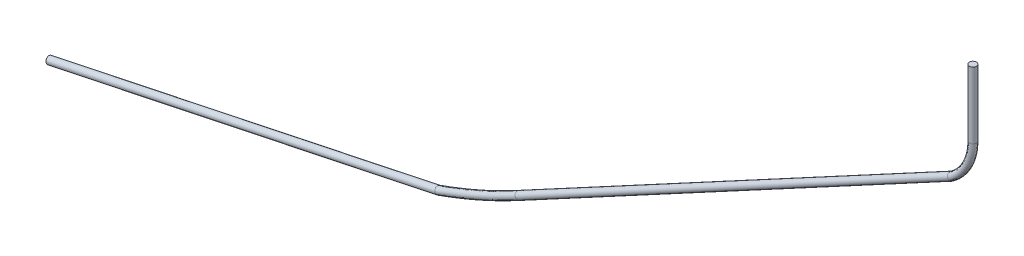
ISO-10303-21;
HEADER;
FILE_DESCRIPTION(('STEP AP214'),'2;1');
FILE_NAME('part.step','',(''),(''),'','','');
FILE_SCHEMA(('AUTOMOTIVE_DESIGN { 1 0 10303 214 1 1 1 1 }'));
ENDSEC;
DATA;
#1=APPLICATION_CONTEXT('core data for automotive mechanical design processes');
#2=APPLICATION_PROTOCOL_DEFINITION('international standard','automotive_design',2000,#1);
#3=PRODUCT_CONTEXT('',#1,'mechanical');
#4=PRODUCT('Part','Part','',(#3));
#5=PRODUCT_RELATED_PRODUCT_CATEGORY('part','',(#4));
#6=PRODUCT_DEFINITION_FORMATION('','',#4);
#7=PRODUCT_DEFINITION_CONTEXT('part definition',#1,'design');
#8=PRODUCT_DEFINITION('design','',#6,#7);
#9=PRODUCT_DEFINITION_SHAPE('','',#8);
#10=(LENGTH_UNIT() NAMED_UNIT(*) SI_UNIT(.MILLI.,.METRE.));
#11=(NAMED_UNIT(*) PLANE_ANGLE_UNIT() SI_UNIT($,.RADIAN.));
#12=(NAMED_UNIT(*) SI_UNIT($,.STERADIAN.) SOLID_ANGLE_UNIT());
#13=UNCERTAINTY_MEASURE_WITH_UNIT(LENGTH_MEASURE(1.E-05),#10,'distance_accuracy_value','');
#14=(GEOMETRIC_REPRESENTATION_CONTEXT(3) GLOBAL_UNCERTAINTY_ASSIGNED_CONTEXT((#13)) GLOBAL_UNIT_ASSIGNED_CONTEXT((#10,
#11,#12)) REPRESENTATION_CONTEXT('',''));
#15=CARTESIAN_POINT('',(0.,0.,0.));
#16=DIRECTION('',(0.,0.,1.));
#17=DIRECTION('',(1.,0.,0.));
#18=AXIS2_PLACEMENT_3D('',#15,#16,#17);
#19=CARTESIAN_POINT('',(-898.137852558053,-445.671560942577,0.));
#20=DIRECTION('',(0.978565795137452,0.205934418169975,0.));
#21=DIRECTION('',(0.,0.,1.));
#22=AXIS2_PLACEMENT_3D('',#19,#20,#21);
#23=PLANE('',#22);
#24=CARTESIAN_POINT('',(-898.137852558053,-445.671560942577,0.));
#25=DIRECTION('',(0.978565795137452,0.205934418169975,0.));
#26=DIRECTION('',(0.,0.,1.));
#27=AXIS2_PLACEMENT_3D('',#24,#25,#26);
#28=CIRCLE('',#27,3.5);
#29=CARTESIAN_POINT('',(-898.137852558053,-445.671560942577,3.5));
#30=VERTEX_POINT('',#29);
#31=EDGE_CURVE('E39',#30,#30,#28,.T.);
#32=ORIENTED_EDGE('',*,*,#31,.F.);
#33=EDGE_LOOP('',(#32));
#34=FACE_BOUND('',#33,.T.);
#35=ADVANCED_FACE('F36',(#34),#23,.F.);
#36=CARTESIAN_POINT('',(0.,0.,0.));
#37=DIRECTION('',(0.,1.,0.));
#38=DIRECTION('',(0.,0.,1.));
#39=AXIS2_PLACEMENT_3D('',#36,#37,#38);
#40=PLANE('',#39);
#41=CARTESIAN_POINT('',(0.,0.,0.));
#42=DIRECTION('',(0.,1.,0.));
#43=DIRECTION('',(0.,0.,1.));
#44=AXIS2_PLACEMENT_3D('',#41,#42,#43);
#45=CIRCLE('',#44,3.5);
#46=CARTESIAN_POINT('',(0.,0.,3.5));
#47=VERTEX_POINT('',#46);
#48=EDGE_CURVE('E65',#47,#47,#45,.T.);
#49=ORIENTED_EDGE('',*,*,#48,.T.);
#50=EDGE_LOOP('',(#49));
#51=FACE_BOUND('',#50,.T.);
#52=ADVANCED_FACE('F91',(#51),#40,.T.);
#53=CARTESIAN_POINT('',(-519.146494057283,-365.91467050953,0.));
#54=DIRECTION('',(-0.978565795137452,-0.205934418169975,0.));
#55=DIRECTION('',(0.205934418169975,-0.978565795137452,0.));
#56=AXIS2_PLACEMENT_3D('',#53,#54,#55);
#57=CYLINDRICAL_SURFACE('',#56,3.5);
#58=CARTESIAN_POINT('',(-519.747286679381,-366.04110439848,3.5));
#59=CARTESIAN_POINT('',(-519.750214648201,-366.030689824779,3.50000006878347));
#60=CARTESIAN_POINT('',(-519.753142782601,-366.020274700953,3.49995012027578));
#61=CARTESIAN_POINT('',(-519.782754392659,-365.914949126424,3.49893943176804));
#62=CARTESIAN_POINT('',(-519.80943963636,-365.820035566233,3.49387711805509));
#63=CARTESIAN_POINT('',(-519.862608962249,-365.630930289061,3.47548027968782));
#64=CARTESIAN_POINT('',(-519.88909293759,-365.536738955279,3.46214163487605));
#65=CARTESIAN_POINT('',(-519.941724449248,-365.349559043257,3.42724049778449));
#66=CARTESIAN_POINT('',(-519.967871144377,-365.256573469992,3.40566046897477));
#67=CARTESIAN_POINT('',(-520.019593843168,-365.072637825458,3.35442660372648));
#68=CARTESIAN_POINT('',(-520.045169397664,-364.981689356081,3.32476663921876));
#69=CARTESIAN_POINT('',(-520.120645731476,-364.713298683893,3.22408897234145));
#70=CARTESIAN_POINT('',(-520.169436174683,-364.539813345614,3.14128010393702));
#71=CARTESIAN_POINT('',(-520.262555279951,-364.208726252431,2.94650843913767));
#72=CARTESIAN_POINT('',(-520.306883760261,-364.051125144543,2.83454445582457));
#73=CARTESIAN_POINT('',(-520.369036941189,-363.830162675809,2.64733154354006));
#74=CARTESIAN_POINT('',(-520.389033849188,-363.759073053451,2.58170579117452));
#75=CARTESIAN_POINT('',(-520.427443961739,-363.622527096453,2.44450868856838));
#76=CARTESIAN_POINT('',(-520.44585867687,-363.557065388599,2.37294314057821));
#77=CARTESIAN_POINT('',(-520.48099561074,-363.432161192744,2.22428903470256));
#78=CARTESIAN_POINT('',(-520.49771699296,-363.372721679746,2.14719777887991));
#79=CARTESIAN_POINT('',(-520.529338630847,-363.260318327463,1.98808167654543));
#80=CARTESIAN_POINT('',(-520.544238466455,-363.207355981844,1.90605569854487));
#81=CARTESIAN_POINT('',(-520.585966860817,-363.059032352564,1.65383183847587));
#82=CARTESIAN_POINT('',(-520.609937454376,-362.973832272474,1.47700836710633));
#83=CARTESIAN_POINT('',(-520.649466186221,-362.833335768093,1.11108940545167));
#84=CARTESIAN_POINT('',(-520.665024597927,-362.778038371874,0.921994314255171));
#85=CARTESIAN_POINT('',(-520.687280251381,-362.6989384465,0.537185029431597));
#86=CARTESIAN_POINT('',(-520.693994771738,-362.675074504737,0.341484510989795));
#87=CARTESIAN_POINT('',(-520.698419306362,-362.659349309498,-0.0512922156745198));
#88=CARTESIAN_POINT('',(-520.696129375502,-362.667487860998,-0.248368415506313));
#89=CARTESIAN_POINT('',(-520.682619317864,-362.715504098756,-0.638113208493365));
#90=CARTESIAN_POINT('',(-520.671407665151,-362.755351667024,-0.830785805738043));
#91=CARTESIAN_POINT('',(-520.640387110228,-362.865605237682,-1.20645365501564));
#92=CARTESIAN_POINT('',(-520.620578099358,-362.936011626296,-1.38944878470456));
#93=CARTESIAN_POINT('',(-520.572919210526,-363.10540972609,-1.74067726365213));
#94=CARTESIAN_POINT('',(-520.545065043645,-363.2044166844,-1.90890267655009));
#95=CARTESIAN_POINT('',(-520.482120641833,-363.42816100116,-2.22572221257332));
#96=CARTESIAN_POINT('',(-520.447030971433,-363.552896352213,-2.37431786578085));
#97=CARTESIAN_POINT('',(-520.370470513009,-363.825064692158,-2.64823767537412));
#98=CARTESIAN_POINT('',(-520.328976151535,-363.972581532935,-2.77347192498144));
#99=CARTESIAN_POINT('',(-520.240866490852,-364.285839268694,-2.99649736850896));
#100=CARTESIAN_POINT('',(-520.194248677317,-364.451589111526,-3.09427500371841));
#101=CARTESIAN_POINT('',(-520.097209421749,-364.796634761972,-3.25962099661543));
#102=CARTESIAN_POINT('',(-520.046785203682,-364.975940456095,-3.32716705255694));
#103=CARTESIAN_POINT('',(-519.943674063839,-365.342622623701,-3.42994404279201));
#104=CARTESIAN_POINT('',(-519.890992096333,-365.52998142833,-3.46524228491912));
#105=CARTESIAN_POINT('',(-519.810712597042,-365.815507915364,-3.49363973371605));
#106=CARTESIAN_POINT('',(-519.78339390064,-365.912674458512,-3.49891834885253));
#107=CARTESIAN_POINT('',(-519.753142862045,-366.02027441849,-3.49995003778511));
#108=CARTESIAN_POINT('',(-519.750214736553,-366.030689510649,-3.49999997729214));
#109=CARTESIAN_POINT('',(-519.747286679379,-366.04110439848,-3.5));
#110=B_SPLINE_CURVE_WITH_KNOTS('',3,(#58,#59,#60,#61,#62,#63,#64,#65,#66,#67,#68,#69,#70,#71,
#72,#73,#74,#75,#76,#77,#78,#79,#80,#81,#82,#83,#84,#85,#86,#87,#88,#89,#90,#91,#92,#93,#94,#95,
#96,#97,#98,#99,#100,#101,#102,#103,#104,#105,#106,#107,#108,#109),.UNSPECIFIED.,.F.,.F.,(4,2,2,
2,2,2,2,2,2,2,2,2,2,2,2,2,2,2,2,2,2,2,2,2,2,4),(0.,0.0324565384115636,0.328223761174329,
0.624138342266367,0.920686129182382,1.21745945616055,1.80944958555931,2.40146381891809,
2.69755192387965,2.99335412651982,3.28930175207596,3.58531749639975,4.17546480591187,
4.76559293269344,5.35456638753079,5.94353625316442,6.53194736778971,7.12036591941917,
7.70909874115067,8.29778564577167,8.88869337848649,9.47989240398172,10.0715268392895,
10.6619235714441,10.9647875053273,10.9972440437389),.UNSPECIFIED.);
#111=CARTESIAN_POINT('',(-519.747286679381,-366.04110439848,3.5));
#112=VERTEX_POINT('',#111);
#113=CARTESIAN_POINT('',(-519.747286679379,-366.04110439848,-3.5));
#114=VERTEX_POINT('',#113);
#115=EDGE_CURVE('E59',#112,#114,#110,.T.);
#116=ORIENTED_EDGE('',*,*,#115,.T.);
#117=CARTESIAN_POINT('',(-519.747286679381,-366.04110439848,3.5));
#118=CARTESIAN_POINT('',(-519.744358710524,-366.051518972171,3.50000006878315));
#119=CARTESIAN_POINT('',(-519.741430586221,-366.061934098836,3.49995012027541));
#120=CARTESIAN_POINT('',(-519.711819422165,-366.167258871381,3.49893943982253));
#121=CARTESIAN_POINT('',(-519.685135444111,-366.262171859858,3.49387720779657));
#122=CARTESIAN_POINT('',(-519.631970296148,-366.45127647259,3.4754806501913));
#123=CARTESIAN_POINT('',(-519.605489233905,-366.545467713898,3.46214220463247));
#124=CARTESIAN_POINT('',(-519.552865126912,-366.732647901546,3.42724155613277));
#125=CARTESIAN_POINT('',(-519.526722926686,-366.825633843994,3.40566181735074));
#126=CARTESIAN_POINT('',(-519.475010670011,-367.009570662495,3.35442859744977));
#127=CARTESIAN_POINT('',(-519.449441063833,-367.100519936971,3.32476898824864));
#128=CARTESIAN_POINT('',(-519.373984478467,-367.368913666968,3.22409242951257));
#129=CARTESIAN_POINT('',(-519.325209777926,-367.542401837309,3.14128436975542));
#130=CARTESIAN_POINT('',(-519.232125625618,-367.873495624767,2.94651441694784));
#131=CARTESIAN_POINT('',(-519.187816355702,-368.031100595054,2.83455133725192));
#132=CARTESIAN_POINT('',(-519.125693053065,-368.252068843527,2.64734018839676));
#133=CARTESIAN_POINT('',(-519.105706325222,-368.323160240496,2.5817152700497));
#134=CARTESIAN_POINT('',(-519.067316591346,-368.459709849542,2.44451993904727));
#135=CARTESIAN_POINT('',(-519.048912074704,-368.525173434749,2.37295532855944));
#136=CARTESIAN_POINT('',(-519.013795278612,-368.650081437662,2.22430320578393));
#137=CARTESIAN_POINT('',(-518.997083835574,-368.709522880314,2.14721299554366));
#138=CARTESIAN_POINT('',(-518.965481527517,-368.821930097873,1.98809909254164));
#139=CARTESIAN_POINT('',(-518.95059108244,-368.874894379079,1.906074268289));
#140=CARTESIAN_POINT('',(-518.908889416567,-369.023224316605,1.65385306762238));
#141=CARTESIAN_POINT('',(-518.884934987261,-369.108428565579,1.47703116294079));
#142=CARTESIAN_POINT('',(-518.84543347577,-369.248932713168,1.11111550740384));
#143=CARTESIAN_POINT('',(-518.829886120999,-369.304233581356,0.92202215465498));
#144=CARTESIAN_POINT('',(-518.807646011186,-369.383340117924,0.537213838483462));
#145=CARTESIAN_POINT('',(-518.800936104479,-369.407206793595,0.341512459638252));
#146=CARTESIAN_POINT('',(-518.796514060651,-369.422935698665,-0.0512662260287994));
#147=CARTESIAN_POINT('',(-518.798801869221,-369.414798121242,-0.248343524538442));
#148=CARTESIAN_POINT('',(-518.81230122187,-369.366781854619,-0.638092385999702));
#149=CARTESIAN_POINT('',(-518.823504369769,-369.326933030051,-0.8307679188478));
#150=CARTESIAN_POINT('',(-518.854502518158,-369.216674755749,-1.20644173318995));
#151=CARTESIAN_POINT('',(-518.874297627136,-369.146264920129,-1.3894398924579));
#152=CARTESIAN_POINT('',(-518.921924796573,-368.976858372249,-1.74067350621555));
#153=CARTESIAN_POINT('',(-518.949761108351,-368.877846538348,-1.90890109011684));
#154=CARTESIAN_POINT('',(-519.012667962721,-368.6540912211,-2.22572466187988));
#155=CARTESIAN_POINT('',(-519.04773794019,-368.529349747861,-2.37432218183882));
#156=CARTESIAN_POINT('',(-519.124258489188,-368.257171485609,-2.64824212096325));
#157=CARTESIAN_POINT('',(-519.16573249878,-368.10965132909,-2.77347515287608));
#158=CARTESIAN_POINT('',(-519.253803822521,-367.796387799845,-2.99649853544984));
#159=CARTESIAN_POINT('',(-519.30040365174,-367.630635481202,-3.09427532989931));
#160=CARTESIAN_POINT('',(-519.397411271215,-367.285586221336,-3.25962003621849));
#161=CARTESIAN_POINT('',(-519.447821840327,-367.106279395939,-3.32716564970618));
#162=CARTESIAN_POINT('',(-519.550911542159,-366.739596659092,-3.42994230210226));
#163=CARTESIAN_POINT('',(-519.603585708742,-366.552238411775,-3.46524064340196));
#164=CARTESIAN_POINT('',(-519.683859866157,-366.266708998777,-3.49363930981879));
#165=CARTESIAN_POINT('',(-519.711178586674,-366.169538276966,-3.49891831141344));
#166=CARTESIAN_POINT('',(-519.741430506818,-366.061934381266,-3.49995003779244));
#167=CARTESIAN_POINT('',(-519.744358622218,-366.051519286266,-3.49999997730038));
#168=CARTESIAN_POINT('',(-519.747286679379,-366.04110439848,-3.5));
#169=B_SPLINE_CURVE_WITH_KNOTS('',3,(#117,#118,#119,#120,#121,#122,#123,#124,#125,#126,#127,
#128,#129,#130,#131,#132,#133,#134,#135,#136,#137,#138,#139,#140,#141,#142,#143,#144,#145,#146,
#147,#148,#149,#150,#151,#152,#153,#154,#155,#156,#157,#158,#159,#160,#161,#162,#163,#164,#165,
#166,#167,#168),.UNSPECIFIED.,.F.,.F.,(4,2,2,2,2,2,2,2,2,2,2,2,2,2,2,2,2,2,2,2,2,2,2,2,2,4),(0.,
0.0324565384116534,0.328221082921768,0.624132980153514,0.920678059461849,1.21744867907985,
1.8094336090267,2.40144263726187,2.69752673726918,2.99332493795039,3.28926856328697,
3.58528030810162,4.17542300813214,4.76554657249785,5.35452313263621,5.94349613772655,
6.53191512247796,7.12034153723936,7.7090796193488,8.29777172414722,8.88867180985538,
9.47986313496338,10.0714898043646,10.661878866274,10.964754881324,10.9972114197356),.UNSPECIFIED.);
#170=EDGE_CURVE('E61',#112,#114,#169,.T.);
#171=ORIENTED_EDGE('',*,*,#170,.F.);
#172=EDGE_LOOP('',(#116,#171));
#173=FACE_BOUND('',#172,.T.);
#174=ORIENTED_EDGE('',*,*,#31,.T.);
#175=EDGE_LOOP('',(#174));
#176=FACE_BOUND('',#175,.T.);
#177=ADVANCED_FACE('F67',(#173,#176),#57,.T.);
#178=CARTESIAN_POINT('',(-20.3028847668204,-104.511621788096,0.));
#179=DIRECTION('',(-0.880443398622848,-0.474151264705102,0.));
#180=DIRECTION('',(0.474151264705102,-0.880443398622848,0.));
#181=AXIS2_PLACEMENT_3D('',#178,#179,#180);
#182=CYLINDRICAL_SURFACE('',#181,3.5);
#183=CARTESIAN_POINT('',(-20.7969174996662,-104.777676648011,3.5));
#184=CARTESIAN_POINT('',(-20.7909133354502,-104.787386334399,3.50000007725062));
#185=CARTESIAN_POINT('',(-20.7849088360938,-104.797096563148,3.49994440719893));
#186=CARTESIAN_POINT('',(-20.7270913875814,-104.890596560323,3.49887183682657));
#187=CARTESIAN_POINT('',(-20.6752779821097,-104.974387094795,3.49376179794762));
#188=CARTESIAN_POINT('',(-20.5720474258439,-105.14132740995,3.47527527274221));
#189=CARTESIAN_POINT('',(-20.520630483544,-105.224476853491,3.46189470219053));
#190=CARTESIAN_POINT('',(-20.4184557005492,-105.389709916654,3.42691610363959));
#191=CARTESIAN_POINT('',(-20.367699500306,-105.471790883507,3.40530060257945));
#192=CARTESIAN_POINT('',(-20.2673003954171,-105.634152483353,3.35400288268269));
#193=CARTESIAN_POINT('',(-20.2176583670928,-105.714431699226,3.32431453955193));
#194=CARTESIAN_POINT('',(-20.0711677595167,-105.951330845174,3.22356395559591));
#195=CARTESIAN_POINT('',(-19.9764822718588,-106.104452765304,3.14072234472893));
#196=CARTESIAN_POINT('',(-19.7957879639359,-106.396665136464,2.9459221346528));
#197=CARTESIAN_POINT('',(-19.7097795161495,-106.53575498514,2.83396228622462));
#198=CARTESIAN_POINT('',(-19.5891886438571,-106.730770383343,2.6467737295214));
#199=CARTESIAN_POINT('',(-19.5503872652484,-106.793518645598,2.58115188807667));
#200=CARTESIAN_POINT('',(-19.4758607625296,-106.914040374655,2.44397061813086));
#201=CARTESIAN_POINT('',(-19.4401327036346,-106.971818587472,2.37241698522231));
#202=CARTESIAN_POINT('',(-19.3719629053783,-107.082060502304,2.22379481925245));
#203=CARTESIAN_POINT('',(-19.339522793827,-107.134521571887,2.14672358642368));
#204=CARTESIAN_POINT('',(-19.2781774570155,-107.233727221625,1.98765553287906));
#205=CARTESIAN_POINT('',(-19.2492730485233,-107.280470480933,1.90565758056162));
#206=CARTESIAN_POINT('',(-19.1683025429696,-107.411413333155,1.65345890371491));
#207=CARTESIAN_POINT('',(-19.1217884646919,-107.486634395915,1.47663676041726));
#208=CARTESIAN_POINT('',(-19.045090412775,-107.610668017567,1.11073575660585));
#209=CARTESIAN_POINT('',(-19.0149059488759,-107.659481369291,0.921657264252173));
#210=CARTESIAN_POINT('',(-18.9717244635495,-107.72931309234,0.536816010361488));
#211=CARTESIAN_POINT('',(-18.9587006553144,-107.750374782431,0.341064156792314));
#212=CARTESIAN_POINT('',(-18.9501385910102,-107.764221081379,-0.0518103148316515));
#213=CARTESIAN_POINT('',(-18.9546002527233,-107.757005823197,-0.248932926436707));
#214=CARTESIAN_POINT('',(-18.9808676262858,-107.714527060679,-0.638803717828214));
#215=CARTESIAN_POINT('',(-19.0026601825102,-107.679284831202,-0.831555101647564));
#216=CARTESIAN_POINT('',(-19.0629492669372,-107.581787252367,-1.20737156151601));
#217=CARTESIAN_POINT('',(-19.1014460100202,-107.51953155551,-1.39043651292618));
#218=CARTESIAN_POINT('',(-19.1940620090978,-107.369755964797,-1.74177257310457));
#219=CARTESIAN_POINT('',(-19.2481880554798,-107.282225089757,-1.91003721010858));
#220=CARTESIAN_POINT('',(-19.3705053464423,-107.084417612679,-2.22691603720949));
#221=CARTESIAN_POINT('',(-19.4386954445282,-106.974142864711,-2.37553182745125));
#222=CARTESIAN_POINT('',(-19.5874248732384,-106.733622683836,-2.64935563704554));
#223=CARTESIAN_POINT('',(-19.6680004254278,-106.603318674868,-2.77449252775528));
#224=CARTESIAN_POINT('',(-19.8390995126611,-106.326623236669,-2.99733092499503));
#225=CARTESIAN_POINT('',(-19.9296279314008,-106.180223909751,-3.09501887847126));
#226=CARTESIAN_POINT('',(-20.118079840077,-105.875466361385,-3.26019079991481));
#227=CARTESIAN_POINT('',(-20.216008851499,-105.717099210902,-3.32765195079715));
#228=CARTESIAN_POINT('',(-20.4162694410358,-105.393245428752,-3.43025870394954));
#229=CARTESIAN_POINT('',(-20.5185913321379,-105.227774462172,-3.46547193628119));
#230=CARTESIAN_POINT('',(-20.6739378640591,-104.9765542792,-3.49363543861803));
#231=CARTESIAN_POINT('',(-20.7264153684005,-104.891689790694,-3.49886008930057));
#232=CARTESIAN_POINT('',(-20.7849086592256,-104.797096849175,-3.49994431317133));
#233=CARTESIAN_POINT('',(-20.790913137857,-104.787386653942,-3.49999997236285));
#234=CARTESIAN_POINT('',(-20.7969174996678,-104.777676648012,-3.5));
#235=B_SPLINE_CURVE_WITH_KNOTS('',3,(#183,#184,#185,#186,#187,#188,#189,#190,#191,#192,#193,
#194,#195,#196,#197,#198,#199,#200,#201,#202,#203,#204,#205,#206,#207,#208,#209,#210,#211,#212,
#213,#214,#215,#216,#217,#218,#219,#220,#221,#222,#223,#224,#225,#226,#227,#228,#229,#230,#231,
#232,#233,#234),.UNSPECIFIED.,.F.,.F.,(4,2,2,2,2,2,2,2,2,2,2,2,2,2,2,2,2,2,2,2,2,2,2,2,2,4),(0.,
0.0342500808160557,0.329794395498746,0.625484775155667,0.921806083483203,1.21835282002983,
1.80988742593337,2.4014474138063,2.69736526474273,2.99299732500665,3.28877504025698,
3.58462095334378,4.17467686846553,4.76471506750739,5.35383115507379,5.94294447258482,
6.53161102926076,7.12028515868744,7.70921543230982,8.2980977155855,8.88873617018523,
9.4796657451396,10.0710406423485,10.6611724538486,10.9605816442305,10.9948317250465),.UNSPECIFIED.);
#236=CARTESIAN_POINT('',(-20.7969174996662,-104.777676648011,3.5));
#237=VERTEX_POINT('',#236);
#238=CARTESIAN_POINT('',(-20.7969174996678,-104.777676648012,-3.5));
#239=VERTEX_POINT('',#238);
#240=EDGE_CURVE('E11',#237,#239,#235,.T.);
#241=ORIENTED_EDGE('',*,*,#240,.F.);
#242=CARTESIAN_POINT('',(-20.7969174996662,-104.777676648011,3.5));
#243=CARTESIAN_POINT('',(-20.8029216635518,-104.767966961411,3.50000007725263));
#244=CARTESIAN_POINT('',(-20.808926264342,-104.758256795397,3.49994440720178));
#245=CARTESIAN_POINT('',(-20.8667498892319,-104.664751178612,3.49887176048614));
#246=CARTESIAN_POINT('',(-20.9185768269415,-104.580959571972,3.49376098412659));
#247=CARTESIAN_POINT('',(-21.0218491364744,-104.41402636196,3.47527193410446));
#248=CARTESIAN_POINT('',(-21.0732943070013,-104.330885100401,3.46188957458276));
#249=CARTESIAN_POINT('',(-21.1755395794932,-104.165677253409,3.42690659638144));
#250=CARTESIAN_POINT('',(-21.2263380703401,-104.083613340391,3.40528849840165));
#251=CARTESIAN_POINT('',(-21.326834639994,-103.921294098091,3.3539850091972));
#252=CARTESIAN_POINT('',(-21.3765318523525,-103.841040192036,3.32429349389875));
#253=CARTESIAN_POINT('',(-21.5232047732457,-103.604228461847,3.22353304433685));
#254=CARTESIAN_POINT('',(-21.6180346784887,-103.451179678178,3.14068426416119));
#255=CARTESIAN_POINT('',(-21.7990492591642,-103.159133532157,2.94586895890456));
#256=CARTESIAN_POINT('',(-21.8852335625166,-103.02013677456,2.83390118137585));
#257=CARTESIAN_POINT('',(-22.0060993016342,-102.825264385855,2.6466969908281));
#258=CARTESIAN_POINT('',(-22.044994949708,-102.762563115568,2.58106762678937));
#259=CARTESIAN_POINT('',(-22.1197101954736,-102.642136483017,2.44387037440955));
#260=CARTESIAN_POINT('',(-22.1555327275916,-102.584406373737,2.37230828242433));
#261=CARTESIAN_POINT('',(-22.2238891196072,-102.474260471807,2.22366821291444));
#262=CARTESIAN_POINT('',(-22.2564213507451,-102.421847311106,2.1465875355192));
#263=CARTESIAN_POINT('',(-22.3179458512754,-102.322735963888,1.98749960349086));
#264=CARTESIAN_POINT('',(-22.3469373028946,-102.276039097592,1.90549121726206));
#265=CARTESIAN_POINT('',(-22.4281543258558,-102.145235395662,1.65326810056499));
#266=CARTESIAN_POINT('',(-22.4748172210111,-102.070101846829,1.47643133149965));
#267=CARTESIAN_POINT('',(-22.5517649571793,-101.946221426314,1.11049935909796));
#268=CARTESIAN_POINT('',(-22.5820503026101,-101.897473741964,0.921404533502694));
#269=CARTESIAN_POINT('',(-22.625369789358,-101.827750010105,0.536554030153824));
#270=CARTESIAN_POINT('',(-22.6384329056114,-101.806727317634,0.340810109688509));
#271=CARTESIAN_POINT('',(-22.6470111596666,-101.792921924149,-0.0520463141612964));
#272=CARTESIAN_POINT('',(-22.6425263924556,-101.800139070271,-0.249158810131874));
#273=CARTESIAN_POINT('',(-22.6161537844915,-101.842583358583,-0.6389912541642));
#274=CARTESIAN_POINT('',(-22.5942805103389,-101.87778705604,-0.831714740017697));
#275=CARTESIAN_POINT('',(-22.5337824470334,-101.975170920442,-1.20747489948621));
#276=CARTESIAN_POINT('',(-22.4951574183285,-102.037351473158,-1.39051143453471));
#277=CARTESIAN_POINT('',(-22.4022508192233,-102.186951182461,-1.74180020452053));
#278=CARTESIAN_POINT('',(-22.3479617240665,-102.274382469099,-1.91004528308785));
#279=CARTESIAN_POINT('',(-22.2253046680765,-102.471974129253,-2.22688692803887));
#280=CARTESIAN_POINT('',(-22.1569379404823,-102.582132511814,-2.37548521366393));
#281=CARTESIAN_POINT('',(-22.0079872707315,-102.822212382602,-2.64904868147284));
#282=CARTESIAN_POINT('',(-21.9273876197618,-102.952159282827,-2.77398300525012));
#283=CARTESIAN_POINT('',(-21.7562946801056,-103.228102570364,-2.99652360487062));
#284=CARTESIAN_POINT('',(-21.6657964837008,-103.374106919188,-3.09411623847174));
#285=CARTESIAN_POINT('',(-21.4771555538795,-103.678564509497,-3.2594844560188));
#286=CARTESIAN_POINT('',(-21.3789837716033,-103.837065077931,-3.32713956974326));
#287=CARTESIAN_POINT('',(-21.1782705922199,-104.161249806682,-3.43004527821679));
#288=CARTESIAN_POINT('',(-21.0757388001886,-104.326918189121,-3.46536359687436));
#289=CARTESIAN_POINT('',(-20.9200978622395,-104.578500378432,-3.49361661104383));
#290=CARTESIAN_POINT('',(-20.8675162666166,-104.663511876771,-3.4988583376132));
#291=CARTESIAN_POINT('',(-20.8089264410009,-104.758256510388,-3.49994431329802));
#292=CARTESIAN_POINT('',(-20.8029218609408,-104.767966642957,-3.49999997250852));
#293=CARTESIAN_POINT('',(-20.7969174996678,-104.777676648012,-3.5));
#294=B_SPLINE_CURVE_WITH_KNOTS('',3,(#242,#243,#244,#245,#246,#247,#248,#249,#250,#251,#252,
#253,#254,#255,#256,#257,#258,#259,#260,#261,#262,#263,#264,#265,#266,#267,#268,#269,#270,#271,
#272,#273,#274,#275,#276,#277,#278,#279,#280,#281,#282,#283,#284,#285,#286,#287,#288,#289,#290,
#291,#292,#293),.UNSPECIFIED.,.F.,.F.,(4,2,2,2,2,2,2,2,2,2,2,2,2,2,2,2,2,2,2,2,2,2,2,2,2,4),(0.,
0.0342500808168668,0.329818479248237,0.625532994450071,0.921878654209096,1.21844973649301,
1.81003102831325,2.40163776906031,2.69759227569836,2.99326096352574,3.28907530373371,
3.58495783610073,4.1750576065319,4.76513920123823,5.35422676156233,5.94331113313951,
6.53190253969087,7.12050236344526,7.70938541285964,8.29821689644656,8.8878110230721,
9.47769880816416,10.0699392142038,10.6609364173191,10.960884957702,10.9951350385189),.UNSPECIFIED.);
#295=EDGE_CURVE('E45',#237,#239,#294,.T.);
#296=ORIENTED_EDGE('',*,*,#295,.T.);
#297=EDGE_LOOP('',(#241,#296));
#298=FACE_BOUND('',#297,.T.);
#299=CARTESIAN_POINT('',(-441.541302424901,-331.364056353867,0.));
#300=DIRECTION('',(0.880443398622848,0.474151264705102,0.));
#301=DIRECTION('',(0.,0.,1.));
#302=AXIS2_PLACEMENT_3D('',#299,#300,#301);
#303=CIRCLE('',#302,3.5);
#304=CARTESIAN_POINT('',(-441.541302424901,-331.364056353867,3.5));
#305=VERTEX_POINT('',#304);
#306=EDGE_CURVE('E69',#305,#305,#303,.T.);
#307=ORIENTED_EDGE('',*,*,#306,.T.);
#308=EDGE_LOOP('',(#307));
#309=FACE_BOUND('',#308,.T.);
#310=ADVANCED_FACE('F90',(#298,#309),#182,.T.);
#311=CARTESIAN_POINT('',(-441.541302424901,-331.364056353867,3.5));
#312=CARTESIAN_POINT('',(-444.682763282324,-333.055848967565,3.5));
#313=CARTESIAN_POINT('',(-447.840427514883,-334.71754183126,3.5));
#314=CARTESIAN_POINT('',(-454.187012308124,-337.980123067402,3.5));
#315=CARTESIAN_POINT('',(-457.375932805613,-339.58101138661,3.5));
#316=CARTESIAN_POINT('',(-466.987828491019,-344.291590786192,3.5));
#317=CARTESIAN_POINT('',(-473.455943848768,-347.309185170866,3.5));
#318=CARTESIAN_POINT('',(-486.503044803684,-353.094356847873,3.5));
#319=CARTESIAN_POINT('',(-493.082028056491,-355.861933099027,3.5));
#320=CARTESIAN_POINT('',(-503.026405007309,-359.822734148399,3.5));
#321=CARTESIAN_POINT('',(-506.353846615253,-361.11124358869,3.5));
#322=CARTESIAN_POINT('',(-513.032811029072,-363.624275719884,3.5));
#323=CARTESIAN_POINT('',(-516.38433429215,-364.848796896497,3.5));
#324=CARTESIAN_POINT('',(-519.940173245082,-366.10949076642,3.5));
#325=CARTESIAN_POINT('',(-520.13305987203,-366.177876961737,3.5));
#326=CARTESIAN_POINT('',(-520.325946468382,-366.24626324336,3.5));
#327=CARTESIAN_POINT('',(-438.222243571966,-337.527160144227,3.5));
#328=CARTESIAN_POINT('',(-441.383385908226,-339.229551960663,3.5));
#329=CARTESIAN_POINT('',(-444.600297607927,-340.922665278443,3.5));
#330=CARTESIAN_POINT('',(-451.026406024071,-344.226127127923,3.5));
#331=CARTESIAN_POINT('',(-454.255284155287,-345.847074808844,3.5));
#332=CARTESIAN_POINT('',(-463.987618280326,-350.616678447524,3.5));
#333=CARTESIAN_POINT('',(-470.53678005639,-353.672083725264,3.5));
#334=CARTESIAN_POINT('',(-483.747363068065,-359.529744437853,3.5));
#335=CARTESIAN_POINT('',(-490.408781930244,-362.331998818688,3.5));
#336=CARTESIAN_POINT('',(-500.477763358399,-366.342429276443,3.5));
#337=CARTESIAN_POINT('',(-503.846898289683,-367.647083925874,3.5));
#338=CARTESIAN_POINT('',(-510.609551091099,-370.19160471222,3.5));
#339=CARTESIAN_POINT('',(-514.024138566752,-371.438939198786,3.5));
#340=CARTESIAN_POINT('',(-517.602255103514,-372.707531416748,3.5));
#341=CARTESIAN_POINT('',(-517.793933282416,-372.775489165994,3.5));
#342=CARTESIAN_POINT('',(-517.986819878768,-372.843875447617,3.5));
#343=CARTESIAN_POINT('',(-438.222243571966,-337.527160144227,-3.5));
#344=CARTESIAN_POINT('',(-441.383385908226,-339.229551960663,-3.5));
#345=CARTESIAN_POINT('',(-444.600297607927,-340.922665278443,-3.5));
#346=CARTESIAN_POINT('',(-451.026406024071,-344.226127127923,-3.5));
#347=CARTESIAN_POINT('',(-454.255284155287,-345.847074808844,-3.5));
#348=CARTESIAN_POINT('',(-463.987618280326,-350.616678447524,-3.5));
#349=CARTESIAN_POINT('',(-470.53678005639,-353.672083725264,-3.5));
#350=CARTESIAN_POINT('',(-483.747363068065,-359.529744437853,-3.5));
#351=CARTESIAN_POINT('',(-490.408781930244,-362.331998818688,-3.5));
#352=CARTESIAN_POINT('',(-500.477763358399,-366.342429276443,-3.5));
#353=CARTESIAN_POINT('',(-503.846898289683,-367.647083925874,-3.5));
#354=CARTESIAN_POINT('',(-510.609551091099,-370.19160471222,-3.5));
#355=CARTESIAN_POINT('',(-514.024138566752,-371.438939198786,-3.5));
#356=CARTESIAN_POINT('',(-517.602255103514,-372.707531416748,-3.5));
#357=CARTESIAN_POINT('',(-517.793933282416,-372.775489165994,-3.5));
#358=CARTESIAN_POINT('',(-517.986819878768,-372.843875447617,-3.5));
#359=CARTESIAN_POINT('',(-441.541302424901,-331.364056353867,-3.5));
#360=CARTESIAN_POINT('',(-444.682763282324,-333.055848967565,-3.5));
#361=CARTESIAN_POINT('',(-447.840427514883,-334.71754183126,-3.5));
#362=CARTESIAN_POINT('',(-454.187012308124,-337.980123067402,-3.5));
#363=CARTESIAN_POINT('',(-457.375932805613,-339.58101138661,-3.5));
#364=CARTESIAN_POINT('',(-466.987828491019,-344.291590786192,-3.5));
#365=CARTESIAN_POINT('',(-473.455943848768,-347.309185170866,-3.5));
#366=CARTESIAN_POINT('',(-486.503044803684,-353.094356847873,-3.5));
#367=CARTESIAN_POINT('',(-493.082028056491,-355.861933099027,-3.5));
#368=CARTESIAN_POINT('',(-503.026405007309,-359.822734148399,-3.5));
#369=CARTESIAN_POINT('',(-506.353846615253,-361.11124358869,-3.5));
#370=CARTESIAN_POINT('',(-513.032811029072,-363.624275719884,-3.5));
#371=CARTESIAN_POINT('',(-516.38433429215,-364.848796896497,-3.5));
#372=CARTESIAN_POINT('',(-519.940173245082,-366.10949076642,-3.5));
#373=CARTESIAN_POINT('',(-520.13305987203,-366.177876961737,-3.5));
#374=CARTESIAN_POINT('',(-520.325946468382,-366.24626324336,-3.5));
#375=CARTESIAN_POINT('',(-444.860361277837,-325.200952563507,-3.5));
#376=CARTESIAN_POINT('',(-447.982140656423,-326.882145974466,-3.5));
#377=CARTESIAN_POINT('',(-451.08055742184,-328.512418384077,-3.5));
#378=CARTESIAN_POINT('',(-457.347618592178,-331.734119006882,-3.5));
#379=CARTESIAN_POINT('',(-460.496581455939,-333.314947964376,-3.5));
#380=CARTESIAN_POINT('',(-469.988038701712,-337.96650312486,-3.5));
#381=CARTESIAN_POINT('',(-476.375107641145,-340.946286616467,-3.5));
#382=CARTESIAN_POINT('',(-489.258726539302,-346.658969257893,-3.5));
#383=CARTESIAN_POINT('',(-495.755274182737,-349.391867379366,-3.5));
#384=CARTESIAN_POINT('',(-505.575046656219,-353.303039020355,-3.5));
#385=CARTESIAN_POINT('',(-508.860794940822,-354.575403251506,-3.5));
#386=CARTESIAN_POINT('',(-515.456070967045,-357.056946727548,-3.5));
#387=CARTESIAN_POINT('',(-518.744530017549,-358.258654594208,-3.5));
#388=CARTESIAN_POINT('',(-522.27809138665,-359.511450116092,-3.5));
#389=CARTESIAN_POINT('',(-522.472186461645,-359.58026475748,-3.5));
#390=CARTESIAN_POINT('',(-522.665073057996,-359.648651039104,-3.5));
#391=CARTESIAN_POINT('',(-444.860361277837,-325.200952563507,3.5));
#392=CARTESIAN_POINT('',(-447.982140656423,-326.882145974466,3.5));
#393=CARTESIAN_POINT('',(-451.08055742184,-328.512418384077,3.5));
#394=CARTESIAN_POINT('',(-457.347618592178,-331.734119006882,3.5));
#395=CARTESIAN_POINT('',(-460.496581455939,-333.314947964376,3.5));
#396=CARTESIAN_POINT('',(-469.988038701712,-337.96650312486,3.5));
#397=CARTESIAN_POINT('',(-476.375107641145,-340.946286616467,3.5));
#398=CARTESIAN_POINT('',(-489.258726539302,-346.658969257893,3.5));
#399=CARTESIAN_POINT('',(-495.755274182737,-349.391867379366,3.5));
#400=CARTESIAN_POINT('',(-505.575046656219,-353.303039020355,3.5));
#401=CARTESIAN_POINT('',(-508.860794940822,-354.575403251506,3.5));
#402=CARTESIAN_POINT('',(-515.456070967045,-357.056946727548,3.5));
#403=CARTESIAN_POINT('',(-518.744530017549,-358.258654594208,3.5));
#404=CARTESIAN_POINT('',(-522.27809138665,-359.511450116092,3.5));
#405=CARTESIAN_POINT('',(-522.472186461645,-359.58026475748,3.5));
#406=CARTESIAN_POINT('',(-522.665073057996,-359.648651039104,3.5));
#407=CARTESIAN_POINT('',(-441.541302424901,-331.364056353867,3.5));
#408=CARTESIAN_POINT('',(-444.682763282324,-333.055848967565,3.5));
#409=CARTESIAN_POINT('',(-447.840427514883,-334.71754183126,3.5));
#410=CARTESIAN_POINT('',(-454.187012308124,-337.980123067402,3.5));
#411=CARTESIAN_POINT('',(-457.375932805613,-339.58101138661,3.5));
#412=CARTESIAN_POINT('',(-466.987828491019,-344.291590786192,3.5));
#413=CARTESIAN_POINT('',(-473.455943848768,-347.309185170866,3.5));
#414=CARTESIAN_POINT('',(-486.503044803684,-353.094356847873,3.5));
#415=CARTESIAN_POINT('',(-493.082028056491,-355.861933099027,3.5));
#416=CARTESIAN_POINT('',(-503.026405007309,-359.822734148399,3.5));
#417=CARTESIAN_POINT('',(-506.353846615253,-361.11124358869,3.5));
#418=CARTESIAN_POINT('',(-513.032811029072,-363.624275719884,3.5));
#419=CARTESIAN_POINT('',(-516.38433429215,-364.848796896497,3.5));
#420=CARTESIAN_POINT('',(-519.940173245082,-366.10949076642,3.5));
#421=CARTESIAN_POINT('',(-520.13305987203,-366.177876961737,3.5));
#422=CARTESIAN_POINT('',(-520.325946468382,-366.24626324336,3.5));
#423=(BOUNDED_SURFACE() B_SPLINE_SURFACE(3,3,((#311,#312,#313,#314,#315,#316,#317,#318,#319,
#320,#321,#322,#323,#324,#325,#326),(#327,#328,#329,#330,#331,#332,#333,#334,#335,#336,#337,
#338,#339,#340,#341,#342),(#343,#344,#345,#346,#347,#348,#349,#350,#351,#352,#353,#354,#355,
#356,#357,#358),(#359,#360,#361,#362,#363,#364,#365,#366,#367,#368,#369,#370,#371,#372,#373,
#374),(#375,#376,#377,#378,#379,#380,#381,#382,#383,#384,#385,#386,#387,#388,#389,#390),(#391,
#392,#393,#394,#395,#396,#397,#398,#399,#400,#401,#402,#403,#404,#405,#406),(#407,#408,#409,
#410,#411,#412,#413,#414,#415,#416,#417,#418,#419,#420,#421,#422)),.UNSPECIFIED.,.T.,.F.,
.F.) B_SPLINE_SURFACE_WITH_KNOTS((4,3,4),(4,2,2,2,2,2,2,4),(0.,0.5,1.),(0.848036552502572,
0.867031983439751,0.886027414376929,0.924018276251286,0.962009138125643,0.981004569062822,1.,
1.00108950797264),.UNSPECIFIED.) GEOMETRIC_REPRESENTATION_ITEM() RATIONAL_B_SPLINE_SURFACE(((1.,
1.,1.,1.,1.,1.,1.,1.,1.,1.,1.,1.,1.,1.,1.,1.),(0.333333333333333,0.333333333333333,
0.333333333333333,0.333333333333333,0.333333333333333,0.333333333333333,0.333333333333333,
0.333333333333333,0.333333333333333,0.333333333333333,0.333333333333333,0.333333333333333,
0.333333333333333,0.333333333333333,0.333333333333333,0.333333333333333),(0.333333333333333,
0.333333333333333,0.333333333333333,0.333333333333333,0.333333333333333,0.333333333333333,
0.333333333333333,0.333333333333333,0.333333333333333,0.333333333333333,0.333333333333333,
0.333333333333333,0.333333333333333,0.333333333333333,0.333333333333333,0.333333333333333),(1.,
1.,1.,1.,1.,1.,1.,1.,1.,1.,1.,1.,1.,1.,1.,1.),(0.333333333333333,0.333333333333333,
0.333333333333333,0.333333333333333,0.333333333333333,0.333333333333333,0.333333333333333,
0.333333333333333,0.333333333333333,0.333333333333333,0.333333333333333,0.333333333333333,
0.333333333333333,0.333333333333333,0.333333333333333,0.333333333333333),(0.333333333333333,
0.333333333333333,0.333333333333333,0.333333333333333,0.333333333333333,0.333333333333333,
0.333333333333333,0.333333333333333,0.333333333333333,0.333333333333333,0.333333333333333,
0.333333333333333,0.333333333333333,0.333333333333333,0.333333333333333,0.333333333333333),(1.,
1.,1.,1.,1.,1.,1.,1.,1.,1.,1.,1.,1.,1.,1.,1.))) REPRESENTATION_ITEM('') SURFACE());
#424=ORIENTED_EDGE('',*,*,#170,.T.);
#425=ORIENTED_EDGE('',*,*,#115,.F.);
#426=EDGE_LOOP('',(#424,#425));
#427=FACE_BOUND('',#426,.T.);
#428=ORIENTED_EDGE('',*,*,#306,.F.);
#429=EDGE_LOOP('',(#428));
#430=FACE_BOUND('',#429,.T.);
#431=ADVANCED_FACE('F62',(#427,#430),#423,.F.);
#432=CARTESIAN_POINT('',(0.,0.,0.));
#433=DIRECTION('',(0.,-1.,0.));
#434=DIRECTION('',(0.,0.,-1.));
#435=AXIS2_PLACEMENT_3D('',#432,#433,#434);
#436=CYLINDRICAL_SURFACE('',#435,3.5);
#437=CARTESIAN_POINT('',(0.,-64.6920765556473,0.));
#438=DIRECTION('',(0.,1.,0.));
#439=DIRECTION('',(0.,0.,1.));
#440=AXIS2_PLACEMENT_3D('',#437,#438,#439);
#441=CIRCLE('',#440,3.5);
#442=CARTESIAN_POINT('',(0.,-64.6920765556473,3.5));
#443=VERTEX_POINT('',#442);
#444=EDGE_CURVE('E130',#443,#443,#441,.T.);
#445=ORIENTED_EDGE('',*,*,#444,.T.);
#446=EDGE_LOOP('',(#445));
#447=FACE_BOUND('',#446,.T.);
#448=ORIENTED_EDGE('',*,*,#48,.F.);
#449=EDGE_LOOP('',(#448));
#450=FACE_BOUND('',#449,.T.);
#451=ADVANCED_FACE('F101',(#447,#450),#436,.T.);
#452=CARTESIAN_POINT('',(0.,-64.6920765556473,3.5));
#453=CARTESIAN_POINT('',(0.,-64.936506044582,3.5));
#454=CARTESIAN_POINT('',(-0.00182783677137115,-65.1809289573235,3.5));
#455=CARTESIAN_POINT('',(-0.00913832116138021,-65.6697115172803,3.5));
#456=CARTESIAN_POINT('',(-0.0146209705190416,-65.914071162996,3.5));
#457=CARTESIAN_POINT('',(-0.0365489804438801,-66.6469789927122,3.5));
#458=CARTESIAN_POINT('',(-0.0584747445298983,-67.1353563596041,3.5));
#459=CARTESIAN_POINT('',(-0.146144491385275,-68.5991839996899,3.5));
#460=CARTESIAN_POINT('',(-0.233787351615129,-69.5733330103118,3.5));
#461=CARTESIAN_POINT('',(-0.583862446371471,-72.4854601964278,3.5));
#462=CARTESIAN_POINT('',(-0.933557557047274,-74.4131179775499,3.5));
#463=CARTESIAN_POINT('',(-2.32411168448171,-80.1128915415977,3.5));
#464=CARTESIAN_POINT('',(-3.70763975825562,-83.8002761349688,3.5));
#465=CARTESIAN_POINT('',(-7.30973193442255,-90.7432294102665,3.5));
#466=CARTESIAN_POINT('',(-9.52730643235675,-93.9970766480339,3.5));
#467=CARTESIAN_POINT('',(-13.3860106197718,-98.415725043484,3.5));
#468=CARTESIAN_POINT('',(-14.7605027332471,-99.811611644109,3.5));
#469=CARTESIAN_POINT('',(-16.9398696395284,-101.77492809156,3.5));
#470=CARTESIAN_POINT('',(-17.6859139070132,-102.407637398123,3.5));
#471=CARTESIAN_POINT('',(-18.8324337297789,-103.32245706848,3.5));
#472=CARTESIAN_POINT('',(-19.2191823181714,-103.621691272261,3.5));
#473=CARTESIAN_POINT('',(-19.8059267782632,-104.061793101125,3.5));
#474=CARTESIAN_POINT('',(-20.0026118712491,-104.207035571076,3.5));
#475=CARTESIAN_POINT('',(-20.3981492463973,-104.494573671549,3.5));
#476=CARTESIAN_POINT('',(-20.5970022514145,-104.636868288242,3.5));
#477=CARTESIAN_POINT('',(-20.9498336640935,-104.885381660429,3.5));
#478=CARTESIAN_POINT('',(-21.1027509376568,-104.993085121044,3.5));
#479=CARTESIAN_POINT('',(-21.2556676566509,-105.100789357565,3.5));
#480=CARTESIAN_POINT('',(7.,-64.6920765556473,3.5));
#481=CARTESIAN_POINT('',(7.,-64.9539544280521,3.5));
#482=CARTESIAN_POINT('',(6.99791120619714,-65.2507215523326,3.5));
#483=CARTESIAN_POINT('',(6.9895570168473,-65.8092867361195,3.5));
#484=CARTESIAN_POINT('',(6.98329161931252,-66.0885331773817,3.5));
#485=CARTESIAN_POINT('',(6.95823298609393,-66.9260769650351,3.5));
#486=CARTESIAN_POINT('',(6.93317691934788,-67.4841791070576,3.5));
#487=CARTESIAN_POINT('',(6.8329907173917,-69.1569948369968,3.5));
#488=CARTESIAN_POINT('',(6.73283524061633,-70.2702213833796,3.5));
#489=CARTESIAN_POINT('',(6.33278054214357,-73.5981078306223,3.5));
#490=CARTESIAN_POINT('',(5.93316007740933,-75.8009739125957,3.5));
#491=CARTESIAN_POINT('',(4.34407899026107,-82.3144940934754,3.5));
#492=CARTESIAN_POINT('',(2.76302705406052,-86.5283200803793,3.5));
#493=CARTESIAN_POINT('',(-1.35332946770014,-94.462506546823,3.5));
#494=CARTESIAN_POINT('',(-3.88750316470442,-98.1808998146364,3.5));
#495=CARTESIAN_POINT('',(-8.29710774187054,-103.230390846651,3.5));
#496=CARTESIAN_POINT('',(-9.86783366966307,-104.825565714777,3.5));
#497=CARTESIAN_POINT('',(-12.3583449445595,-107.069181387965,3.5));
#498=CARTESIAN_POINT('',(-13.2109006360277,-107.792221486076,3.5));
#499=CARTESIAN_POINT('',(-14.5211070713272,-108.837648346943,3.5));
#500=CARTESIAN_POINT('',(-14.9630710734269,-109.179603690125,3.5));
#501=CARTESIAN_POINT('',(-15.6335840050178,-109.682538080718,3.5));
#502=CARTESIAN_POINT('',(-15.8583494817599,-109.848516561883,3.5));
#503=CARTESIAN_POINT('',(-16.3103570301953,-110.177105969719,3.5));
#504=CARTESIAN_POINT('',(-16.551870753362,-110.349767145969,3.5));
#505=CARTESIAN_POINT('',(-16.9298886338807,-110.616020553827,3.5));
#506=CARTESIAN_POINT('',(-17.0718901615123,-110.716035531745,3.5));
#507=CARTESIAN_POINT('',(-17.2248068805064,-110.823739768265,3.5));
#508=CARTESIAN_POINT('',(7.,-64.6920765556473,-3.5));
#509=CARTESIAN_POINT('',(7.,-64.9539544280521,-3.5));
#510=CARTESIAN_POINT('',(6.99791120619714,-65.2507215523326,-3.5));
#511=CARTESIAN_POINT('',(6.9895570168473,-65.8092867361195,-3.5));
#512=CARTESIAN_POINT('',(6.98329161931252,-66.0885331773817,-3.5));
#513=CARTESIAN_POINT('',(6.95823298609393,-66.9260769650351,-3.5));
#514=CARTESIAN_POINT('',(6.93317691934788,-67.4841791070576,-3.5));
#515=CARTESIAN_POINT('',(6.8329907173917,-69.1569948369968,-3.5));
#516=CARTESIAN_POINT('',(6.73283524061633,-70.2702213833796,-3.5));
#517=CARTESIAN_POINT('',(6.33278054214357,-73.5981078306223,-3.5));
#518=CARTESIAN_POINT('',(5.93316007740933,-75.8009739125957,-3.5));
#519=CARTESIAN_POINT('',(4.34407899026107,-82.3144940934754,-3.5));
#520=CARTESIAN_POINT('',(2.76302705406052,-86.5283200803793,-3.5));
#521=CARTESIAN_POINT('',(-1.35332946770014,-94.462506546823,-3.5));
#522=CARTESIAN_POINT('',(-3.88750316470442,-98.1808998146364,-3.5));
#523=CARTESIAN_POINT('',(-8.29710774187054,-103.230390846651,-3.5));
#524=CARTESIAN_POINT('',(-9.86783366966307,-104.825565714777,-3.5));
#525=CARTESIAN_POINT('',(-12.3583449445595,-107.069181387965,-3.5));
#526=CARTESIAN_POINT('',(-13.2109006360277,-107.792221486076,-3.5));
#527=CARTESIAN_POINT('',(-14.5211070713272,-108.837648346943,-3.5));
#528=CARTESIAN_POINT('',(-14.9630710734269,-109.179603690125,-3.5));
#529=CARTESIAN_POINT('',(-15.6335840050178,-109.682538080718,-3.5));
#530=CARTESIAN_POINT('',(-15.8583494817599,-109.848516561883,-3.5));
#531=CARTESIAN_POINT('',(-16.3103570301953,-110.177105969719,-3.5));
#532=CARTESIAN_POINT('',(-16.551870753362,-110.349767145969,-3.5));
#533=CARTESIAN_POINT('',(-16.9298886338807,-110.616020553827,-3.5));
#534=CARTESIAN_POINT('',(-17.0718901615123,-110.716035531745,-3.5));
#535=CARTESIAN_POINT('',(-17.2248068805064,-110.823739768265,-3.5));
#536=CARTESIAN_POINT('',(0.,-64.6920765556473,-3.5));
#537=CARTESIAN_POINT('',(0.,-64.936506044582,-3.5));
#538=CARTESIAN_POINT('',(-0.00182783677137072,-65.1809289573235,-3.5));
#539=CARTESIAN_POINT('',(-0.00913832116137978,-65.6697115172803,-3.5));
#540=CARTESIAN_POINT('',(-0.0146209705190412,-65.914071162996,-3.5));
#541=CARTESIAN_POINT('',(-0.0365489804438797,-66.6469789927122,-3.5));
#542=CARTESIAN_POINT('',(-0.0584747445298978,-67.1353563596041,-3.5));
#543=CARTESIAN_POINT('',(-0.146144491385274,-68.5991839996899,-3.5));
#544=CARTESIAN_POINT('',(-0.233787351615129,-69.5733330103118,-3.5));
#545=CARTESIAN_POINT('',(-0.58386244637147,-72.4854601964278,-3.5));
#546=CARTESIAN_POINT('',(-0.933557557047274,-74.4131179775499,-3.5));
#547=CARTESIAN_POINT('',(-2.32411168448171,-80.1128915415977,-3.5));
#548=CARTESIAN_POINT('',(-3.70763975825562,-83.8002761349688,-3.5));
#549=CARTESIAN_POINT('',(-7.30973193442255,-90.7432294102665,-3.5));
#550=CARTESIAN_POINT('',(-9.52730643235675,-93.9970766480339,-3.5));
#551=CARTESIAN_POINT('',(-13.3860106197718,-98.415725043484,-3.5));
#552=CARTESIAN_POINT('',(-14.7605027332471,-99.811611644109,-3.5));
#553=CARTESIAN_POINT('',(-16.9398696395284,-101.77492809156,-3.5));
#554=CARTESIAN_POINT('',(-17.6859139070132,-102.407637398123,-3.5));
#555=CARTESIAN_POINT('',(-18.8324337297789,-103.32245706848,-3.5));
#556=CARTESIAN_POINT('',(-19.2191823181714,-103.621691272261,-3.5));
#557=CARTESIAN_POINT('',(-19.8059267782632,-104.061793101125,-3.5));
#558=CARTESIAN_POINT('',(-20.0026118712491,-104.207035571076,-3.5));
#559=CARTESIAN_POINT('',(-20.3981492463973,-104.494573671549,-3.5));
#560=CARTESIAN_POINT('',(-20.5970022514145,-104.636868288242,-3.5));
#561=CARTESIAN_POINT('',(-20.9498336640935,-104.885381660429,-3.5));
#562=CARTESIAN_POINT('',(-21.1027509376568,-104.993085121044,-3.5));
#563=CARTESIAN_POINT('',(-21.2556676566509,-105.100789357565,-3.5));
#564=CARTESIAN_POINT('',(-7.,-64.6920765556473,-3.5));
#565=CARTESIAN_POINT('',(-7.,-64.9190576611118,-3.5));
#566=CARTESIAN_POINT('',(-7.00156687973989,-65.1111363623143,-3.5));
#567=CARTESIAN_POINT('',(-7.00783365917006,-65.5301362984411,-3.5));
#568=CARTESIAN_POINT('',(-7.0125335603506,-65.7396091486102,-3.5));
#569=CARTESIAN_POINT('',(-7.03133094698168,-66.3678810203893,-3.5));
#570=CARTESIAN_POINT('',(-7.05012640840767,-66.7865336121506,-3.5));
#571=CARTESIAN_POINT('',(-7.12527970016225,-68.0413731623828,-3.5));
#572=CARTESIAN_POINT('',(-7.20040994384659,-68.8764446372439,-3.5));
#573=CARTESIAN_POINT('',(-7.50050543488651,-71.3728125622333,-3.5));
#574=CARTESIAN_POINT('',(-7.80027519150387,-73.0252620425041,-3.5));
#575=CARTESIAN_POINT('',(-8.99230235922449,-77.91128898972,-3.5));
#576=CARTESIAN_POINT('',(-10.1783065705718,-81.0722321895583,-3.5));
#577=CARTESIAN_POINT('',(-13.2661344011449,-87.0239522737099,-3.5));
#578=CARTESIAN_POINT('',(-15.1671097000091,-89.8132534814313,-3.5));
#579=CARTESIAN_POINT('',(-18.4749134976731,-93.6010592403166,-3.5));
#580=CARTESIAN_POINT('',(-19.6531717968312,-94.7976575734414,-3.5));
#581=CARTESIAN_POINT('',(-21.5213943344974,-96.4806747951561,-3.5));
#582=CARTESIAN_POINT('',(-22.1609271779986,-97.0230533101698,-3.5));
#583=CARTESIAN_POINT('',(-23.1437603882305,-97.8072657900167,-3.5));
#584=CARTESIAN_POINT('',(-23.4752935629158,-98.0637788543976,-3.5));
#585=CARTESIAN_POINT('',(-23.9782695515085,-98.4410481215327,-3.5));
#586=CARTESIAN_POINT('',(-24.1468742607382,-98.5655545802686,-3.5));
#587=CARTESIAN_POINT('',(-24.4859414625994,-98.8120413733797,-3.5));
#588=CARTESIAN_POINT('',(-24.642133749467,-98.9239694305144,-3.5));
#589=CARTESIAN_POINT('',(-24.9697786943063,-99.15474276703,-3.5));
#590=CARTESIAN_POINT('',(-25.1336117138013,-99.2701347103436,-3.5));
#591=CARTESIAN_POINT('',(-25.2865284327954,-99.377838946864,-3.5));
#592=CARTESIAN_POINT('',(-7.,-64.6920765556473,3.5));
#593=CARTESIAN_POINT('',(-7.,-64.9190576611118,3.5));
#594=CARTESIAN_POINT('',(-7.00156687973989,-65.1111363623143,3.5));
#595=CARTESIAN_POINT('',(-7.00783365917006,-65.5301362984411,3.5));
#596=CARTESIAN_POINT('',(-7.0125335603506,-65.7396091486102,3.5));
#597=CARTESIAN_POINT('',(-7.03133094698168,-66.3678810203893,3.5));
#598=CARTESIAN_POINT('',(-7.05012640840767,-66.7865336121506,3.5));
#599=CARTESIAN_POINT('',(-7.12527970016225,-68.0413731623828,3.5));
#600=CARTESIAN_POINT('',(-7.20040994384659,-68.8764446372439,3.5));
#601=CARTESIAN_POINT('',(-7.50050543488651,-71.3728125622333,3.5));
#602=CARTESIAN_POINT('',(-7.80027519150387,-73.0252620425041,3.5));
#603=CARTESIAN_POINT('',(-8.99230235922449,-77.91128898972,3.5));
#604=CARTESIAN_POINT('',(-10.1783065705717,-81.0722321895583,3.5));
#605=CARTESIAN_POINT('',(-13.2661344011449,-87.0239522737099,3.5));
#606=CARTESIAN_POINT('',(-15.1671097000091,-89.8132534814313,3.5));
#607=CARTESIAN_POINT('',(-18.4749134976731,-93.6010592403166,3.5));
#608=CARTESIAN_POINT('',(-19.6531717968312,-94.7976575734414,3.5));
#609=CARTESIAN_POINT('',(-21.5213943344974,-96.4806747951561,3.5));
#610=CARTESIAN_POINT('',(-22.1609271779986,-97.0230533101698,3.5));
#611=CARTESIAN_POINT('',(-23.1437603882305,-97.8072657900167,3.5));
#612=CARTESIAN_POINT('',(-23.4752935629158,-98.0637788543976,3.5));
#613=CARTESIAN_POINT('',(-23.9782695515085,-98.4410481215327,3.5));
#614=CARTESIAN_POINT('',(-24.1468742607382,-98.5655545802686,3.5));
#615=CARTESIAN_POINT('',(-24.4859414625994,-98.8120413733797,3.5));
#616=CARTESIAN_POINT('',(-24.642133749467,-98.9239694305144,3.5));
#617=CARTESIAN_POINT('',(-24.9697786943063,-99.15474276703,3.5));
#618=CARTESIAN_POINT('',(-25.1336117138013,-99.2701347103436,3.5));
#619=CARTESIAN_POINT('',(-25.2865284327954,-99.377838946864,3.5));
#620=CARTESIAN_POINT('',(0.,-64.6920765556473,3.5));
#621=CARTESIAN_POINT('',(0.,-64.936506044582,3.5));
#622=CARTESIAN_POINT('',(-0.00182783677137115,-65.1809289573235,3.5));
#623=CARTESIAN_POINT('',(-0.00913832116138021,-65.6697115172803,3.5));
#624=CARTESIAN_POINT('',(-0.0146209705190416,-65.914071162996,3.5));
#625=CARTESIAN_POINT('',(-0.0365489804438801,-66.6469789927122,3.5));
#626=CARTESIAN_POINT('',(-0.0584747445298983,-67.1353563596041,3.5));
#627=CARTESIAN_POINT('',(-0.146144491385275,-68.5991839996899,3.5));
#628=CARTESIAN_POINT('',(-0.233787351615129,-69.5733330103118,3.5));
#629=CARTESIAN_POINT('',(-0.583862446371471,-72.4854601964278,3.5));
#630=CARTESIAN_POINT('',(-0.933557557047274,-74.4131179775499,3.5));
#631=CARTESIAN_POINT('',(-2.32411168448171,-80.1128915415977,3.5));
#632=CARTESIAN_POINT('',(-3.70763975825562,-83.8002761349688,3.5));
#633=CARTESIAN_POINT('',(-7.30973193442255,-90.7432294102665,3.5));
#634=CARTESIAN_POINT('',(-9.52730643235675,-93.9970766480339,3.5));
#635=CARTESIAN_POINT('',(-13.3860106197718,-98.415725043484,3.5));
#636=CARTESIAN_POINT('',(-14.7605027332471,-99.811611644109,3.5));
#637=CARTESIAN_POINT('',(-16.9398696395284,-101.77492809156,3.5));
#638=CARTESIAN_POINT('',(-17.6859139070132,-102.407637398123,3.5));
#639=CARTESIAN_POINT('',(-18.8324337297789,-103.32245706848,3.5));
#640=CARTESIAN_POINT('',(-19.2191823181714,-103.621691272261,3.5));
#641=CARTESIAN_POINT('',(-19.8059267782632,-104.061793101125,3.5));
#642=CARTESIAN_POINT('',(-20.0026118712491,-104.207035571076,3.5));
#643=CARTESIAN_POINT('',(-20.3981492463973,-104.494573671549,3.5));
#644=CARTESIAN_POINT('',(-20.5970022514145,-104.636868288242,3.5));
#645=CARTESIAN_POINT('',(-20.9498336640935,-104.885381660429,3.5));
#646=CARTESIAN_POINT('',(-21.1027509376568,-104.993085121044,3.5));
#647=CARTESIAN_POINT('',(-21.2556676566509,-105.100789357565,3.5));
#648=(BOUNDED_SURFACE() B_SPLINE_SURFACE(3,3,((#452,#453,#454,#455,#456,#457,#458,#459,#460,
#461,#462,#463,#464,#465,#466,#467,#468,#469,#470,#471,#472,#473,#474,#475,#476,#477,#478,#479),
(#480,#481,#482,#483,#484,#485,#486,#487,#488,#489,#490,#491,#492,#493,#494,#495,#496,#497,#498,
#499,#500,#501,#502,#503,#504,#505,#506,#507),(#508,#509,#510,#511,#512,#513,#514,#515,#516,
#517,#518,#519,#520,#521,#522,#523,#524,#525,#526,#527,#528,#529,#530,#531,#532,#533,#534,#535),
(#536,#537,#538,#539,#540,#541,#542,#543,#544,#545,#546,#547,#548,#549,#550,#551,#552,#553,#554,
#555,#556,#557,#558,#559,#560,#561,#562,#563),(#564,#565,#566,#567,#568,#569,#570,#571,#572,
#573,#574,#575,#576,#577,#578,#579,#580,#581,#582,#583,#584,#585,#586,#587,#588,#589,#590,#591),
(#592,#593,#594,#595,#596,#597,#598,#599,#600,#601,#602,#603,#604,#605,#606,#607,#608,#609,#610,
#611,#612,#613,#614,#615,#616,#617,#618,#619),(#620,#621,#622,#623,#624,#625,#626,#627,#628,
#629,#630,#631,#632,#633,#634,#635,#636,#637,#638,#639,#640,#641,#642,#643,#644,#645,#646,
#647)),.UNSPECIFIED.,.T.,.F.,.F.) B_SPLINE_SURFACE_WITH_KNOTS((4,3,4),(4,2,2,2,2,2,2,2,2,2,2,2,
2,4),(0.,0.5,1.),(0.579561058769344,0.586130417226073,0.592699775682802,0.60583849259626,
0.632115926423176,0.684670794077008,0.789780529384672,0.894890264692336,0.947445132346168,
0.973722566173084,0.986861283086542,0.993430641543271,1.,1.00502493484982),
.UNSPECIFIED.) GEOMETRIC_REPRESENTATION_ITEM() RATIONAL_B_SPLINE_SURFACE(((1.,1.,1.,1.,1.,1.,1.,
1.,1.,1.,1.,1.,1.,1.,1.,1.,1.,1.,1.,1.,1.,1.,1.,1.,1.,1.,1.,1.),(0.333333333333333,
0.333333333333333,0.333333333333333,0.333333333333333,0.333333333333333,0.333333333333333,
0.333333333333333,0.333333333333333,0.333333333333333,0.333333333333333,0.333333333333333,
0.333333333333333,0.333333333333333,0.333333333333333,0.333333333333333,0.333333333333333,
0.333333333333333,0.333333333333333,0.333333333333333,0.333333333333333,0.333333333333333,
0.333333333333333,0.333333333333333,0.333333333333333,0.333333333333333,0.333333333333333,
0.333333333333333,0.333333333333333),(0.333333333333333,0.333333333333333,0.333333333333333,
0.333333333333333,0.333333333333333,0.333333333333333,0.333333333333333,0.333333333333333,
0.333333333333333,0.333333333333333,0.333333333333333,0.333333333333333,0.333333333333333,
0.333333333333333,0.333333333333333,0.333333333333333,0.333333333333333,0.333333333333333,
0.333333333333333,0.333333333333333,0.333333333333333,0.333333333333333,0.333333333333333,
0.333333333333333,0.333333333333333,0.333333333333333,0.333333333333333,0.333333333333333),(1.,
1.,1.,1.,1.,1.,1.,1.,1.,1.,1.,1.,1.,1.,1.,1.,1.,1.,1.,1.,1.,1.,1.,1.,1.,1.,1.,1.),
(0.333333333333333,0.333333333333333,0.333333333333333,0.333333333333333,0.333333333333333,
0.333333333333333,0.333333333333333,0.333333333333333,0.333333333333333,0.333333333333333,
0.333333333333333,0.333333333333333,0.333333333333333,0.333333333333333,0.333333333333333,
0.333333333333333,0.333333333333333,0.333333333333333,0.333333333333333,0.333333333333333,
0.333333333333333,0.333333333333333,0.333333333333333,0.333333333333333,0.333333333333333,
0.333333333333333,0.333333333333333,0.333333333333333),(0.333333333333333,0.333333333333333,
0.333333333333333,0.333333333333333,0.333333333333333,0.333333333333333,0.333333333333333,
0.333333333333333,0.333333333333333,0.333333333333333,0.333333333333333,0.333333333333333,
0.333333333333333,0.333333333333333,0.333333333333333,0.333333333333333,0.333333333333333,
0.333333333333333,0.333333333333333,0.333333333333333,0.333333333333333,0.333333333333333,
0.333333333333333,0.333333333333333,0.333333333333333,0.333333333333333,0.333333333333333,
0.333333333333333),(1.,1.,1.,1.,1.,1.,1.,1.,1.,1.,1.,1.,1.,1.,1.,1.,1.,1.,1.,1.,1.,1.,1.,1.,1.,
1.,1.,1.))) REPRESENTATION_ITEM('') SURFACE());
#649=ORIENTED_EDGE('',*,*,#240,.T.);
#650=ORIENTED_EDGE('',*,*,#295,.F.);
#651=EDGE_LOOP('',(#649,#650));
#652=FACE_BOUND('',#651,.T.);
#653=ORIENTED_EDGE('',*,*,#444,.F.);
#654=EDGE_LOOP('',(#653));
#655=FACE_BOUND('',#654,.T.);
#656=ADVANCED_FACE('F99',(#652,#655),#648,.F.);
#657=CLOSED_SHELL('',(#35,#52,#177,#310,#431,#451,#656));
#658=MANIFOLD_SOLID_BREP('B2',#657);
#659=ADVANCED_BREP_SHAPE_REPRESENTATION('',(#18,#658),#14);
#660=SHAPE_DEFINITION_REPRESENTATION(#9,#659);
ENDSEC;
END-ISO-10303-21;
